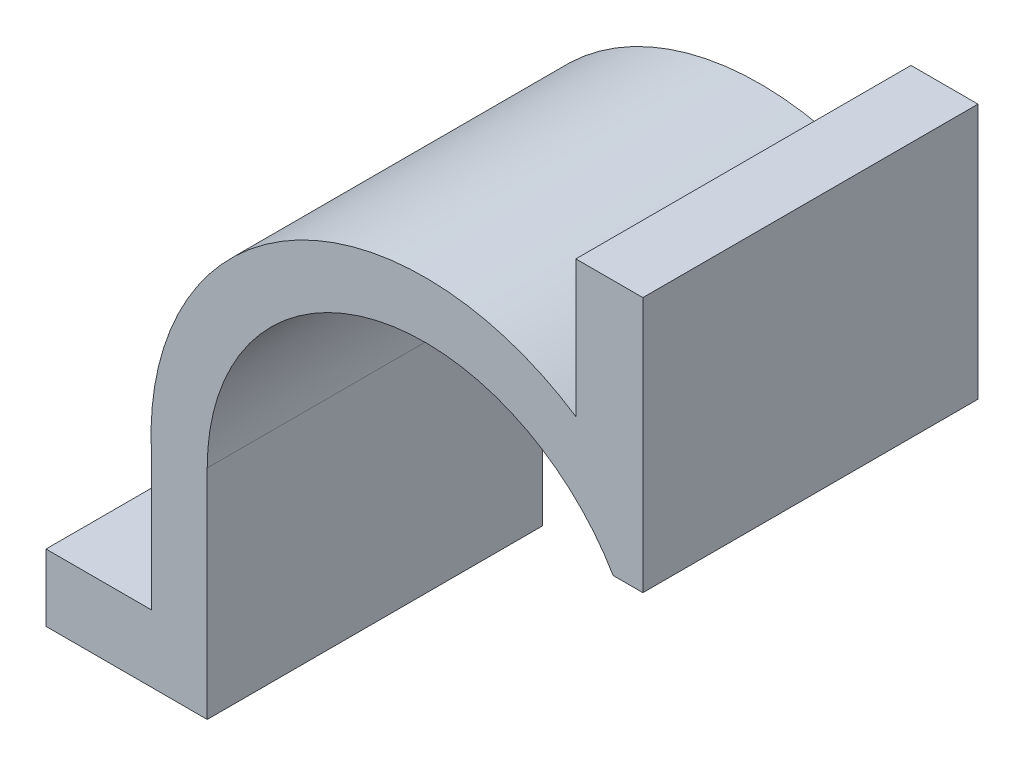
ISO-10303-21;
HEADER;
FILE_DESCRIPTION(('STEP AP214'),'2;1');
FILE_NAME('part.step','',(''),(''),'','','');
FILE_SCHEMA(('AUTOMOTIVE_DESIGN { 1 0 10303 214 1 1 1 1 }'));
ENDSEC;
DATA;
#1=APPLICATION_CONTEXT('core data for automotive mechanical design processes');
#2=APPLICATION_PROTOCOL_DEFINITION('international standard','automotive_design',2000,#1);
#3=PRODUCT_CONTEXT('',#1,'mechanical');
#4=PRODUCT('Part','Part','',(#3));
#5=PRODUCT_RELATED_PRODUCT_CATEGORY('part','',(#4));
#6=PRODUCT_DEFINITION_FORMATION('','',#4);
#7=PRODUCT_DEFINITION_CONTEXT('part definition',#1,'design');
#8=PRODUCT_DEFINITION('design','',#6,#7);
#9=PRODUCT_DEFINITION_SHAPE('','',#8);
#10=(LENGTH_UNIT() NAMED_UNIT(*) SI_UNIT(.MILLI.,.METRE.));
#11=(NAMED_UNIT(*) PLANE_ANGLE_UNIT() SI_UNIT($,.RADIAN.));
#12=(NAMED_UNIT(*) SI_UNIT($,.STERADIAN.) SOLID_ANGLE_UNIT());
#13=UNCERTAINTY_MEASURE_WITH_UNIT(LENGTH_MEASURE(1.E-05),#10,'distance_accuracy_value','');
#14=(GEOMETRIC_REPRESENTATION_CONTEXT(3) GLOBAL_UNCERTAINTY_ASSIGNED_CONTEXT((#13)) GLOBAL_UNIT_ASSIGNED_CONTEXT((#10,
#11,#12)) REPRESENTATION_CONTEXT('',''));
#15=CARTESIAN_POINT('',(0.,0.,0.));
#16=DIRECTION('',(0.,0.,1.));
#17=DIRECTION('',(1.,0.,0.));
#18=AXIS2_PLACEMENT_3D('',#15,#16,#17);
#19=CARTESIAN_POINT('',(32.5,54.5132524656899,-50.));
#20=DIRECTION('',(0.,1.,0.));
#21=DIRECTION('',(0.,0.,1.));
#22=AXIS2_PLACEMENT_3D('',#19,#20,#21);
#23=PLANE('',#22);
#24=DIRECTION('',(-1.,0.,0.));
#25=VECTOR('',#24,1.);
#26=CARTESIAN_POINT('',(32.5,54.5132524656899,0.));
#27=LINE('',#26,#25);
#28=CARTESIAN_POINT('',(32.5,54.5132524656899,0.));
#29=VERTEX_POINT('',#28);
#30=CARTESIAN_POINT('',(22.5,54.5132524656899,0.));
#31=VERTEX_POINT('',#30);
#32=EDGE_CURVE('E148',#29,#31,#27,.T.);
#33=ORIENTED_EDGE('',*,*,#32,.F.);
#34=DIRECTION('',(0.,0.,1.));
#35=VECTOR('',#34,1.);
#36=CARTESIAN_POINT('',(32.5,54.5132524656899,-50.));
#37=LINE('',#36,#35);
#38=CARTESIAN_POINT('',(32.5,54.5132524656899,-50.));
#39=VERTEX_POINT('',#38);
#40=EDGE_CURVE('E11',#39,#29,#37,.T.);
#41=ORIENTED_EDGE('',*,*,#40,.F.);
#42=DIRECTION('',(-1.,0.,0.));
#43=VECTOR('',#42,1.);
#44=CARTESIAN_POINT('',(32.5,54.5132524656899,-50.));
#45=LINE('',#44,#43);
#46=CARTESIAN_POINT('',(22.5,54.5132524656899,-50.));
#47=VERTEX_POINT('',#46);
#48=EDGE_CURVE('E177',#39,#47,#45,.T.);
#49=ORIENTED_EDGE('',*,*,#48,.T.);
#50=DIRECTION('',(0.,0.,1.));
#51=VECTOR('',#50,1.);
#52=CARTESIAN_POINT('',(22.5,54.5132524656899,-50.));
#53=LINE('',#52,#51);
#54=EDGE_CURVE('E36',#47,#31,#53,.T.);
#55=ORIENTED_EDGE('',*,*,#54,.T.);
#56=EDGE_LOOP('',(#33,#41,#49,#55));
#57=FACE_BOUND('',#56,.T.);
#58=ADVANCED_FACE('F33',(#57),#23,.T.);
#59=CARTESIAN_POINT('',(32.5,16.3816947292974,-50.));
#60=DIRECTION('',(1.,0.,0.));
#61=DIRECTION('',(0.,0.,-1.));
#62=AXIS2_PLACEMENT_3D('',#59,#60,#61);
#63=PLANE('',#62);
#64=DIRECTION('',(0.,1.,0.));
#65=VECTOR('',#64,1.);
#66=CARTESIAN_POINT('',(32.5,16.3816947292974,0.));
#67=LINE('',#66,#65);
#68=CARTESIAN_POINT('',(32.5,16.3816947292974,0.));
#69=VERTEX_POINT('',#68);
#70=EDGE_CURVE('E175',#69,#29,#67,.T.);
#71=ORIENTED_EDGE('',*,*,#70,.F.);
#72=DIRECTION('',(0.,0.,1.));
#73=VECTOR('',#72,1.);
#74=CARTESIAN_POINT('',(32.5,16.3816947292974,-50.));
#75=LINE('',#74,#73);
#76=CARTESIAN_POINT('',(32.5,16.3816947292974,-50.));
#77=VERTEX_POINT('',#76);
#78=EDGE_CURVE('E42',#77,#69,#75,.T.);
#79=ORIENTED_EDGE('',*,*,#78,.F.);
#80=DIRECTION('',(0.,1.,0.));
#81=VECTOR('',#80,1.);
#82=CARTESIAN_POINT('',(32.5,16.3816947292974,-50.));
#83=LINE('',#82,#81);
#84=EDGE_CURVE('E138',#77,#39,#83,.T.);
#85=ORIENTED_EDGE('',*,*,#84,.T.);
#86=ORIENTED_EDGE('',*,*,#40,.T.);
#87=EDGE_LOOP('',(#71,#79,#85,#86));
#88=FACE_BOUND('',#87,.T.);
#89=ADVANCED_FACE('F195',(#88),#63,.T.);
#90=CARTESIAN_POINT('',(28.0693797187631,16.3816947292974,-50.));
#91=DIRECTION('',(0.,-1.,0.));
#92=DIRECTION('',(0.,0.,-1.));
#93=AXIS2_PLACEMENT_3D('',#90,#91,#92);
#94=PLANE('',#93);
#95=DIRECTION('',(1.,0.,0.));
#96=VECTOR('',#95,1.);
#97=CARTESIAN_POINT('',(28.0693797187631,16.3816947292974,0.));
#98=LINE('',#97,#96);
#99=CARTESIAN_POINT('',(28.0693797187631,16.3816947292974,0.));
#100=VERTEX_POINT('',#99);
#101=EDGE_CURVE('E125',#100,#69,#98,.T.);
#102=ORIENTED_EDGE('',*,*,#101,.F.);
#103=DIRECTION('',(0.,0.,1.));
#104=VECTOR('',#103,1.);
#105=CARTESIAN_POINT('',(28.0693797187631,16.3816947292974,-50.));
#106=LINE('',#105,#104);
#107=CARTESIAN_POINT('',(28.0693797187631,16.3816947292974,-50.));
#108=VERTEX_POINT('',#107);
#109=EDGE_CURVE('E120',#108,#100,#106,.T.);
#110=ORIENTED_EDGE('',*,*,#109,.F.);
#111=DIRECTION('',(1.,0.,0.));
#112=VECTOR('',#111,1.);
#113=CARTESIAN_POINT('',(28.0693797187631,16.3816947292974,-50.));
#114=LINE('',#113,#112);
#115=EDGE_CURVE('E123',#108,#77,#114,.T.);
#116=ORIENTED_EDGE('',*,*,#115,.T.);
#117=ORIENTED_EDGE('',*,*,#78,.T.);
#118=EDGE_LOOP('',(#102,#110,#116,#117));
#119=FACE_BOUND('',#118,.T.);
#120=ADVANCED_FACE('F122',(#119),#94,.T.);
#121=CARTESIAN_POINT('',(0.,0.,-50.));
#122=DIRECTION('',(0.,0.,1.));
#123=DIRECTION('',(1.,0.,0.));
#124=AXIS2_PLACEMENT_3D('',#121,#122,#123);
#125=CYLINDRICAL_SURFACE('',#124,32.5);
#126=CARTESIAN_POINT('',(0.,0.,0.));
#127=DIRECTION('',(0.,0.,-1.));
#128=DIRECTION('',(-1.,0.,0.));
#129=AXIS2_PLACEMENT_3D('',#126,#127,#128);
#130=CIRCLE('',#129,32.5);
#131=CARTESIAN_POINT('',(-32.5,0.,0.));
#132=VERTEX_POINT('',#131);
#133=EDGE_CURVE('E172',#132,#100,#130,.T.);
#134=ORIENTED_EDGE('',*,*,#133,.F.);
#135=DIRECTION('',(0.,0.,1.));
#136=VECTOR('',#135,1.);
#137=CARTESIAN_POINT('',(-32.5,0.,-50.));
#138=LINE('',#137,#136);
#139=CARTESIAN_POINT('',(-32.5,0.,-50.));
#140=VERTEX_POINT('',#139);
#141=EDGE_CURVE('E130',#140,#132,#138,.T.);
#142=ORIENTED_EDGE('',*,*,#141,.F.);
#143=CARTESIAN_POINT('',(0.,0.,-50.));
#144=DIRECTION('',(0.,0.,-1.));
#145=DIRECTION('',(-1.,0.,0.));
#146=AXIS2_PLACEMENT_3D('',#143,#144,#145);
#147=CIRCLE('',#146,32.5);
#148=EDGE_CURVE('E136',#140,#108,#147,.T.);
#149=ORIENTED_EDGE('',*,*,#148,.T.);
#150=ORIENTED_EDGE('',*,*,#109,.T.);
#151=EDGE_LOOP('',(#134,#142,#149,#150));
#152=FACE_BOUND('',#151,.T.);
#153=ADVANCED_FACE('F140',(#152),#125,.F.);
#154=CARTESIAN_POINT('',(-32.5,0.,-50.));
#155=DIRECTION('',(1.,0.,0.));
#156=DIRECTION('',(0.,0.,-1.));
#157=AXIS2_PLACEMENT_3D('',#154,#155,#156);
#158=PLANE('',#157);
#159=DIRECTION('',(0.,1.,0.));
#160=VECTOR('',#159,1.);
#161=CARTESIAN_POINT('',(-32.5,0.,0.));
#162=LINE('',#161,#160);
#163=CARTESIAN_POINT('',(-32.5,-32.5,0.));
#164=VERTEX_POINT('',#163);
#165=EDGE_CURVE('E169',#164,#132,#162,.T.);
#166=ORIENTED_EDGE('',*,*,#165,.F.);
#167=DIRECTION('',(0.,0.,1.));
#168=VECTOR('',#167,1.);
#169=CARTESIAN_POINT('',(-32.5,-32.5,-50.));
#170=LINE('',#169,#168);
#171=CARTESIAN_POINT('',(-32.5,-32.5,-50.));
#172=VERTEX_POINT('',#171);
#173=EDGE_CURVE('E181',#172,#164,#170,.T.);
#174=ORIENTED_EDGE('',*,*,#173,.F.);
#175=DIRECTION('',(0.,1.,0.));
#176=VECTOR('',#175,1.);
#177=CARTESIAN_POINT('',(-32.5,0.,-50.));
#178=LINE('',#177,#176);
#179=EDGE_CURVE('E141',#172,#140,#178,.T.);
#180=ORIENTED_EDGE('',*,*,#179,.T.);
#181=ORIENTED_EDGE('',*,*,#141,.T.);
#182=EDGE_LOOP('',(#166,#174,#180,#181));
#183=FACE_BOUND('',#182,.T.);
#184=ADVANCED_FACE('F208',(#183),#158,.T.);
#185=CARTESIAN_POINT('',(-32.5,-32.5,-50.));
#186=DIRECTION('',(0.,-1.,0.));
#187=DIRECTION('',(0.,0.,-1.));
#188=AXIS2_PLACEMENT_3D('',#185,#186,#187);
#189=PLANE('',#188);
#190=DIRECTION('',(1.,0.,0.));
#191=VECTOR('',#190,1.);
#192=CARTESIAN_POINT('',(-32.5,-32.5,0.));
#193=LINE('',#192,#191);
#194=CARTESIAN_POINT('',(-56.5532456386384,-32.5,0.));
#195=VERTEX_POINT('',#194);
#196=EDGE_CURVE('E166',#195,#164,#193,.T.);
#197=ORIENTED_EDGE('',*,*,#196,.F.);
#198=DIRECTION('',(0.,0.,1.));
#199=VECTOR('',#198,1.);
#200=CARTESIAN_POINT('',(-56.5532456386384,-32.5,-50.));
#201=LINE('',#200,#199);
#202=CARTESIAN_POINT('',(-56.5532456386384,-32.5,-50.));
#203=VERTEX_POINT('',#202);
#204=EDGE_CURVE('E183',#203,#195,#201,.T.);
#205=ORIENTED_EDGE('',*,*,#204,.F.);
#206=DIRECTION('',(1.,0.,0.));
#207=VECTOR('',#206,1.);
#208=CARTESIAN_POINT('',(-32.5,-32.5,-50.));
#209=LINE('',#208,#207);
#210=EDGE_CURVE('E143',#203,#172,#209,.T.);
#211=ORIENTED_EDGE('',*,*,#210,.T.);
#212=ORIENTED_EDGE('',*,*,#173,.T.);
#213=EDGE_LOOP('',(#197,#205,#211,#212));
#214=FACE_BOUND('',#213,.T.);
#215=ADVANCED_FACE('F211',(#214),#189,.T.);
#216=CARTESIAN_POINT('',(-56.5532456386384,-32.5,-50.));
#217=DIRECTION('',(-1.,0.,0.));
#218=DIRECTION('',(0.,0.,1.));
#219=AXIS2_PLACEMENT_3D('',#216,#217,#218);
#220=PLANE('',#219);
#221=DIRECTION('',(0.,-1.,0.));
#222=VECTOR('',#221,1.);
#223=CARTESIAN_POINT('',(-56.5532456386384,-32.5,0.));
#224=LINE('',#223,#222);
#225=CARTESIAN_POINT('',(-56.5532456386384,-22.5,0.));
#226=VERTEX_POINT('',#225);
#227=EDGE_CURVE('E163',#226,#195,#224,.T.);
#228=ORIENTED_EDGE('',*,*,#227,.F.);
#229=DIRECTION('',(0.,0.,1.));
#230=VECTOR('',#229,1.);
#231=CARTESIAN_POINT('',(-56.5532456386384,-22.5,-50.));
#232=LINE('',#231,#230);
#233=CARTESIAN_POINT('',(-56.5532456386384,-22.5,-50.));
#234=VERTEX_POINT('',#233);
#235=EDGE_CURVE('E185',#234,#226,#232,.T.);
#236=ORIENTED_EDGE('',*,*,#235,.F.);
#237=DIRECTION('',(0.,-1.,0.));
#238=VECTOR('',#237,1.);
#239=CARTESIAN_POINT('',(-56.5532456386384,-32.5,-50.));
#240=LINE('',#239,#238);
#241=EDGE_CURVE('E327',#234,#203,#240,.T.);
#242=ORIENTED_EDGE('',*,*,#241,.T.);
#243=ORIENTED_EDGE('',*,*,#204,.T.);
#244=EDGE_LOOP('',(#228,#236,#242,#243));
#245=FACE_BOUND('',#244,.T.);
#246=ADVANCED_FACE('F215',(#245),#220,.T.);
#247=CARTESIAN_POINT('',(-56.5532456386384,-22.5,-50.));
#248=DIRECTION('',(0.,1.,0.));
#249=DIRECTION('',(0.,0.,1.));
#250=AXIS2_PLACEMENT_3D('',#247,#248,#249);
#251=PLANE('',#250);
#252=DIRECTION('',(-1.,0.,0.));
#253=VECTOR('',#252,1.);
#254=CARTESIAN_POINT('',(-56.5532456386384,-22.5,0.));
#255=LINE('',#254,#253);
#256=CARTESIAN_POINT('',(-40.8373789001678,-22.5,0.));
#257=VERTEX_POINT('',#256);
#258=EDGE_CURVE('E160',#257,#226,#255,.T.);
#259=ORIENTED_EDGE('',*,*,#258,.F.);
#260=DIRECTION('',(0.,0.,1.));
#261=VECTOR('',#260,1.);
#262=CARTESIAN_POINT('',(-40.8373789001678,-22.5,-50.));
#263=LINE('',#262,#261);
#264=CARTESIAN_POINT('',(-40.8373789001678,-22.5,-50.));
#265=VERTEX_POINT('',#264);
#266=EDGE_CURVE('E187',#265,#257,#263,.T.);
#267=ORIENTED_EDGE('',*,*,#266,.F.);
#268=DIRECTION('',(-1.,0.,0.));
#269=VECTOR('',#268,1.);
#270=CARTESIAN_POINT('',(-56.5532456386384,-22.5,-50.));
#271=LINE('',#270,#269);
#272=EDGE_CURVE('E320',#265,#234,#271,.T.);
#273=ORIENTED_EDGE('',*,*,#272,.T.);
#274=ORIENTED_EDGE('',*,*,#235,.T.);
#275=EDGE_LOOP('',(#259,#267,#273,#274));
#276=FACE_BOUND('',#275,.T.);
#277=ADVANCED_FACE('F219',(#276),#251,.T.);
#278=CARTESIAN_POINT('',(-40.8373789001678,-22.5,-50.));
#279=DIRECTION('',(-1.,0.,0.));
#280=DIRECTION('',(0.,0.,1.));
#281=AXIS2_PLACEMENT_3D('',#278,#279,#280);
#282=PLANE('',#281);
#283=DIRECTION('',(0.,-1.,0.));
#284=VECTOR('',#283,1.);
#285=CARTESIAN_POINT('',(-40.8373789001678,-22.5,0.));
#286=LINE('',#285,#284);
#287=CARTESIAN_POINT('',(-40.8373789001678,-2.01080485490786,0.));
#288=VERTEX_POINT('',#287);
#289=EDGE_CURVE('E157',#288,#257,#286,.T.);
#290=ORIENTED_EDGE('',*,*,#289,.F.);
#291=DIRECTION('',(0.,0.,1.));
#292=VECTOR('',#291,1.);
#293=CARTESIAN_POINT('',(-40.8373789001678,-2.01080485490786,-50.));
#294=LINE('',#293,#292);
#295=CARTESIAN_POINT('',(-40.8373789001678,-2.01080485490786,-50.));
#296=VERTEX_POINT('',#295);
#297=EDGE_CURVE('E189',#296,#288,#294,.T.);
#298=ORIENTED_EDGE('',*,*,#297,.F.);
#299=DIRECTION('',(0.,-1.,0.));
#300=VECTOR('',#299,1.);
#301=CARTESIAN_POINT('',(-40.8373789001678,-22.5,-50.));
#302=LINE('',#301,#300);
#303=EDGE_CURVE('E316',#296,#265,#302,.T.);
#304=ORIENTED_EDGE('',*,*,#303,.T.);
#305=ORIENTED_EDGE('',*,*,#266,.T.);
#306=EDGE_LOOP('',(#290,#298,#304,#305));
#307=FACE_BOUND('',#306,.T.);
#308=ADVANCED_FACE('F223',(#307),#282,.T.);
#309=CARTESIAN_POINT('',(0.,0.,-50.));
#310=DIRECTION('',(0.,0.,1.));
#311=DIRECTION('',(1.,0.,0.));
#312=AXIS2_PLACEMENT_3D('',#309,#310,#311);
#313=CYLINDRICAL_SURFACE('',#312,40.8868542639366);
#314=CARTESIAN_POINT('',(0.,0.,0.));
#315=DIRECTION('',(0.,0.,1.));
#316=DIRECTION('',(-1.,0.,0.));
#317=AXIS2_PLACEMENT_3D('',#314,#315,#316);
#318=CIRCLE('',#317,40.8868542639366);
#319=CARTESIAN_POINT('',(22.5,34.1391981686798,0.));
#320=VERTEX_POINT('',#319);
#321=EDGE_CURVE('E154',#320,#288,#318,.T.);
#322=ORIENTED_EDGE('',*,*,#321,.F.);
#323=DIRECTION('',(0.,0.,1.));
#324=VECTOR('',#323,1.);
#325=CARTESIAN_POINT('',(22.5,34.1391981686798,-50.));
#326=LINE('',#325,#324);
#327=CARTESIAN_POINT('',(22.5,34.1391981686798,-50.));
#328=VERTEX_POINT('',#327);
#329=EDGE_CURVE('E190',#328,#320,#326,.T.);
#330=ORIENTED_EDGE('',*,*,#329,.F.);
#331=CARTESIAN_POINT('',(0.,0.,-50.));
#332=DIRECTION('',(0.,0.,1.));
#333=DIRECTION('',(-1.,0.,0.));
#334=AXIS2_PLACEMENT_3D('',#331,#332,#333);
#335=CIRCLE('',#334,40.8868542639366);
#336=EDGE_CURVE('E332',#328,#296,#335,.T.);
#337=ORIENTED_EDGE('',*,*,#336,.T.);
#338=ORIENTED_EDGE('',*,*,#297,.T.);
#339=EDGE_LOOP('',(#322,#330,#337,#338));
#340=FACE_BOUND('',#339,.T.);
#341=ADVANCED_FACE('F227',(#340),#313,.T.);
#342=CARTESIAN_POINT('',(22.5,54.5132524656899,-50.));
#343=DIRECTION('',(-1.,0.,0.));
#344=DIRECTION('',(0.,0.,1.));
#345=AXIS2_PLACEMENT_3D('',#342,#343,#344);
#346=PLANE('',#345);
#347=DIRECTION('',(0.,-1.,0.));
#348=VECTOR('',#347,1.);
#349=CARTESIAN_POINT('',(22.5,54.5132524656899,0.));
#350=LINE('',#349,#348);
#351=EDGE_CURVE('E151',#31,#320,#350,.T.);
#352=ORIENTED_EDGE('',*,*,#351,.F.);
#353=ORIENTED_EDGE('',*,*,#54,.F.);
#354=DIRECTION('',(0.,-1.,0.));
#355=VECTOR('',#354,1.);
#356=CARTESIAN_POINT('',(22.5,54.5132524656899,-50.));
#357=LINE('',#356,#355);
#358=EDGE_CURVE('E334',#47,#328,#357,.T.);
#359=ORIENTED_EDGE('',*,*,#358,.T.);
#360=ORIENTED_EDGE('',*,*,#329,.T.);
#361=EDGE_LOOP('',(#352,#353,#359,#360));
#362=FACE_BOUND('',#361,.T.);
#363=ADVANCED_FACE('F192',(#362),#346,.T.);
#364=CARTESIAN_POINT('',(0.,0.,-50.));
#365=DIRECTION('',(0.,0.,-1.));
#366=DIRECTION('',(-1.,0.,0.));
#367=AXIS2_PLACEMENT_3D('',#364,#365,#366);
#368=PLANE('',#367);
#369=ORIENTED_EDGE('',*,*,#48,.F.);
#370=ORIENTED_EDGE('',*,*,#84,.F.);
#371=ORIENTED_EDGE('',*,*,#115,.F.);
#372=ORIENTED_EDGE('',*,*,#148,.F.);
#373=ORIENTED_EDGE('',*,*,#179,.F.);
#374=ORIENTED_EDGE('',*,*,#210,.F.);
#375=ORIENTED_EDGE('',*,*,#241,.F.);
#376=ORIENTED_EDGE('',*,*,#272,.F.);
#377=ORIENTED_EDGE('',*,*,#303,.F.);
#378=ORIENTED_EDGE('',*,*,#336,.F.);
#379=ORIENTED_EDGE('',*,*,#358,.F.);
#380=EDGE_LOOP('',(#369,#370,#371,#372,#373,#374,#375,#376,#377,#378,#379));
#381=FACE_BOUND('',#380,.T.);
#382=ADVANCED_FACE('F134',(#381),#368,.T.);
#383=CARTESIAN_POINT('',(0.,0.,0.));
#384=DIRECTION('',(0.,0.,-1.));
#385=DIRECTION('',(-1.,0.,0.));
#386=AXIS2_PLACEMENT_3D('',#383,#384,#385);
#387=PLANE('',#386);
#388=ORIENTED_EDGE('',*,*,#32,.T.);
#389=ORIENTED_EDGE('',*,*,#351,.T.);
#390=ORIENTED_EDGE('',*,*,#321,.T.);
#391=ORIENTED_EDGE('',*,*,#289,.T.);
#392=ORIENTED_EDGE('',*,*,#258,.T.);
#393=ORIENTED_EDGE('',*,*,#227,.T.);
#394=ORIENTED_EDGE('',*,*,#196,.T.);
#395=ORIENTED_EDGE('',*,*,#165,.T.);
#396=ORIENTED_EDGE('',*,*,#133,.T.);
#397=ORIENTED_EDGE('',*,*,#101,.T.);
#398=ORIENTED_EDGE('',*,*,#70,.T.);
#399=EDGE_LOOP('',(#388,#389,#390,#391,#392,#393,#394,#395,#396,#397,#398));
#400=FACE_BOUND('',#399,.T.);
#401=ADVANCED_FACE('F194',(#400),#387,.F.);
#402=CLOSED_SHELL('',(#58,#89,#120,#153,#184,#215,#246,#277,#308,#341,#363,#382,#401));
#403=MANIFOLD_SOLID_BREP('B2',#402);
#404=ADVANCED_BREP_SHAPE_REPRESENTATION('',(#18,#403),#14);
#405=SHAPE_DEFINITION_REPRESENTATION(#9,#404);
ENDSEC;
END-ISO-10303-21;
